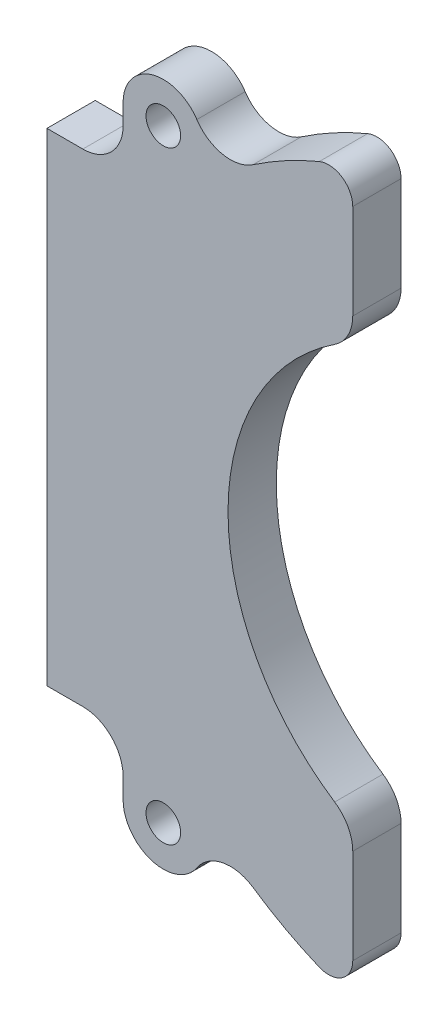
ISO-10303-21;
HEADER;
FILE_DESCRIPTION(('STEP AP214'),'2;1');
FILE_NAME('part.step','',(''),(''),'','','');
FILE_SCHEMA(('AUTOMOTIVE_DESIGN { 1 0 10303 214 1 1 1 1 }'));
ENDSEC;
DATA;
#1=APPLICATION_CONTEXT('core data for automotive mechanical design processes');
#2=APPLICATION_PROTOCOL_DEFINITION('international standard','automotive_design',2000,#1);
#3=PRODUCT_CONTEXT('',#1,'mechanical');
#4=PRODUCT('Part','Part','',(#3));
#5=PRODUCT_RELATED_PRODUCT_CATEGORY('part','',(#4));
#6=PRODUCT_DEFINITION_FORMATION('','',#4);
#7=PRODUCT_DEFINITION_CONTEXT('part definition',#1,'design');
#8=PRODUCT_DEFINITION('design','',#6,#7);
#9=PRODUCT_DEFINITION_SHAPE('','',#8);
#10=(LENGTH_UNIT() NAMED_UNIT(*) SI_UNIT(.MILLI.,.METRE.));
#11=(NAMED_UNIT(*) PLANE_ANGLE_UNIT() SI_UNIT($,.RADIAN.));
#12=(NAMED_UNIT(*) SI_UNIT($,.STERADIAN.) SOLID_ANGLE_UNIT());
#13=UNCERTAINTY_MEASURE_WITH_UNIT(LENGTH_MEASURE(1.E-05),#10,'distance_accuracy_value','');
#14=(GEOMETRIC_REPRESENTATION_CONTEXT(3) GLOBAL_UNCERTAINTY_ASSIGNED_CONTEXT((#13)) GLOBAL_UNIT_ASSIGNED_CONTEXT((#10,
#11,#12)) REPRESENTATION_CONTEXT('',''));
#15=CARTESIAN_POINT('',(0.,0.,0.));
#16=DIRECTION('',(0.,0.,1.));
#17=DIRECTION('',(1.,0.,0.));
#18=AXIS2_PLACEMENT_3D('',#15,#16,#17);
#19=CARTESIAN_POINT('',(-42.54,0.,6.));
#20=DIRECTION('',(1.,0.,0.));
#21=DIRECTION('',(0.,0.,-1.));
#22=AXIS2_PLACEMENT_3D('',#19,#20,#21);
#23=PLANE('',#22);
#24=DIRECTION('',(0.,-1.,0.));
#25=VECTOR('',#24,1.);
#26=CARTESIAN_POINT('',(-42.54,0.,0.));
#27=LINE('',#26,#25);
#28=CARTESIAN_POINT('',(-42.54,37.5,0.));
#29=VERTEX_POINT('',#28);
#30=CARTESIAN_POINT('',(-42.54,35.,0.));
#31=VERTEX_POINT('',#30);
#32=EDGE_CURVE('E200',#29,#31,#27,.T.);
#33=ORIENTED_EDGE('',*,*,#32,.T.);
#34=DIRECTION('',(0.,0.,-1.));
#35=VECTOR('',#34,1.);
#36=CARTESIAN_POINT('',(-42.54,35.,6.));
#37=LINE('',#36,#35);
#38=CARTESIAN_POINT('',(-42.54,35.,6.));
#39=VERTEX_POINT('',#38);
#40=EDGE_CURVE('E178',#39,#31,#37,.T.);
#41=ORIENTED_EDGE('',*,*,#40,.F.);
#42=DIRECTION('',(0.,-1.,0.));
#43=VECTOR('',#42,1.);
#44=CARTESIAN_POINT('',(-42.54,0.,6.));
#45=LINE('',#44,#43);
#46=CARTESIAN_POINT('',(-42.54,37.5,6.));
#47=VERTEX_POINT('',#46);
#48=EDGE_CURVE('E185',#47,#39,#45,.T.);
#49=ORIENTED_EDGE('',*,*,#48,.F.);
#50=DIRECTION('',(0.,0.,-1.));
#51=VECTOR('',#50,1.);
#52=CARTESIAN_POINT('',(-42.54,37.5,6.));
#53=LINE('',#52,#51);
#54=EDGE_CURVE('E269',#47,#29,#53,.T.);
#55=ORIENTED_EDGE('',*,*,#54,.T.);
#56=EDGE_LOOP('',(#33,#41,#49,#55));
#57=FACE_BOUND('',#56,.T.);
#58=ADVANCED_FACE('F36',(#57),#23,.F.);
#59=CARTESIAN_POINT('',(-47.54,35.,6.));
#60=DIRECTION('',(0.,0.,-1.));
#61=DIRECTION('',(-1.,0.,0.));
#62=AXIS2_PLACEMENT_3D('',#59,#60,#61);
#63=CYLINDRICAL_SURFACE('',#62,5.);
#64=CARTESIAN_POINT('',(-47.54,35.,0.));
#65=DIRECTION('',(0.,0.,1.));
#66=DIRECTION('',(1.,0.,0.));
#67=AXIS2_PLACEMENT_3D('',#64,#65,#66);
#68=CIRCLE('',#67,5.);
#69=CARTESIAN_POINT('',(-47.54,30.,0.));
#70=VERTEX_POINT('',#69);
#71=EDGE_CURVE('E278',#31,#70,#68,.F.);
#72=ORIENTED_EDGE('',*,*,#71,.T.);
#73=DIRECTION('',(0.,0.,-1.));
#74=VECTOR('',#73,1.);
#75=CARTESIAN_POINT('',(-47.54,30.,6.));
#76=LINE('',#75,#74);
#77=CARTESIAN_POINT('',(-47.54,30.,6.));
#78=VERTEX_POINT('',#77);
#79=EDGE_CURVE('E181',#78,#70,#76,.T.);
#80=ORIENTED_EDGE('',*,*,#79,.F.);
#81=CARTESIAN_POINT('',(-47.54,35.,6.));
#82=DIRECTION('',(0.,0.,1.));
#83=DIRECTION('',(1.,0.,0.));
#84=AXIS2_PLACEMENT_3D('',#81,#82,#83);
#85=CIRCLE('',#84,5.);
#86=EDGE_CURVE('E174',#39,#78,#85,.F.);
#87=ORIENTED_EDGE('',*,*,#86,.F.);
#88=ORIENTED_EDGE('',*,*,#40,.T.);
#89=EDGE_LOOP('',(#72,#80,#87,#88));
#90=FACE_BOUND('',#89,.T.);
#91=ADVANCED_FACE('F176',(#90),#63,.F.);
#92=CARTESIAN_POINT('',(0.,30.,6.));
#93=DIRECTION('',(0.,-1.,0.));
#94=DIRECTION('',(0.,0.,-1.));
#95=AXIS2_PLACEMENT_3D('',#92,#93,#94);
#96=PLANE('',#95);
#97=DIRECTION('',(-1.,0.,0.));
#98=VECTOR('',#97,1.);
#99=CARTESIAN_POINT('',(0.,30.,0.));
#100=LINE('',#99,#98);
#101=CARTESIAN_POINT('',(-52.,30.,0.));
#102=VERTEX_POINT('',#101);
#103=EDGE_CURVE('E280',#70,#102,#100,.T.);
#104=ORIENTED_EDGE('',*,*,#103,.T.);
#105=DIRECTION('',(0.,0.,-1.));
#106=VECTOR('',#105,1.);
#107=CARTESIAN_POINT('',(-52.,30.,6.));
#108=LINE('',#107,#106);
#109=CARTESIAN_POINT('',(-52.,30.,6.));
#110=VERTEX_POINT('',#109);
#111=EDGE_CURVE('E205',#110,#102,#108,.T.);
#112=ORIENTED_EDGE('',*,*,#111,.F.);
#113=DIRECTION('',(-1.,0.,0.));
#114=VECTOR('',#113,1.);
#115=CARTESIAN_POINT('',(0.,30.,6.));
#116=LINE('',#115,#114);
#117=EDGE_CURVE('E184',#78,#110,#116,.T.);
#118=ORIENTED_EDGE('',*,*,#117,.F.);
#119=ORIENTED_EDGE('',*,*,#79,.T.);
#120=EDGE_LOOP('',(#104,#112,#118,#119));
#121=FACE_BOUND('',#120,.T.);
#122=ADVANCED_FACE('F335',(#121),#96,.F.);
#123=CARTESIAN_POINT('',(-52.,0.,6.));
#124=DIRECTION('',(-1.,0.,0.));
#125=DIRECTION('',(0.,0.,1.));
#126=AXIS2_PLACEMENT_3D('',#123,#124,#125);
#127=PLANE('',#126);
#128=DIRECTION('',(0.,1.,0.));
#129=VECTOR('',#128,1.);
#130=CARTESIAN_POINT('',(-52.,0.,0.));
#131=LINE('',#130,#129);
#132=CARTESIAN_POINT('',(-52.,-30.,0.));
#133=VERTEX_POINT('',#132);
#134=EDGE_CURVE('E283',#133,#102,#131,.T.);
#135=ORIENTED_EDGE('',*,*,#134,.F.);
#136=DIRECTION('',(0.,0.,-1.));
#137=VECTOR('',#136,1.);
#138=CARTESIAN_POINT('',(-52.,-30.,6.));
#139=LINE('',#138,#137);
#140=CARTESIAN_POINT('',(-52.,-30.,6.));
#141=VERTEX_POINT('',#140);
#142=EDGE_CURVE('E325',#141,#133,#139,.T.);
#143=ORIENTED_EDGE('',*,*,#142,.F.);
#144=DIRECTION('',(0.,1.,0.));
#145=VECTOR('',#144,1.);
#146=CARTESIAN_POINT('',(-52.,0.,6.));
#147=LINE('',#146,#145);
#148=EDGE_CURVE('E332',#141,#110,#147,.T.);
#149=ORIENTED_EDGE('',*,*,#148,.T.);
#150=ORIENTED_EDGE('',*,*,#111,.T.);
#151=EDGE_LOOP('',(#135,#143,#149,#150));
#152=FACE_BOUND('',#151,.T.);
#153=ADVANCED_FACE('F330',(#152),#127,.T.);
#154=CARTESIAN_POINT('',(0.,-30.,6.));
#155=DIRECTION('',(0.,-1.,0.));
#156=DIRECTION('',(0.,0.,-1.));
#157=AXIS2_PLACEMENT_3D('',#154,#155,#156);
#158=PLANE('',#157);
#159=DIRECTION('',(-1.,0.,0.));
#160=VECTOR('',#159,1.);
#161=CARTESIAN_POINT('',(0.,-30.,0.));
#162=LINE('',#161,#160);
#163=CARTESIAN_POINT('',(-47.54,-30.,0.));
#164=VERTEX_POINT('',#163);
#165=EDGE_CURVE('E286',#164,#133,#162,.T.);
#166=ORIENTED_EDGE('',*,*,#165,.F.);
#167=DIRECTION('',(0.,0.,-1.));
#168=VECTOR('',#167,1.);
#169=CARTESIAN_POINT('',(-47.54,-30.,6.));
#170=LINE('',#169,#168);
#171=CARTESIAN_POINT('',(-47.54,-30.,6.));
#172=VERTEX_POINT('',#171);
#173=EDGE_CURVE('E323',#172,#164,#170,.T.);
#174=ORIENTED_EDGE('',*,*,#173,.F.);
#175=DIRECTION('',(-1.,0.,0.));
#176=VECTOR('',#175,1.);
#177=CARTESIAN_POINT('',(0.,-30.,6.));
#178=LINE('',#177,#176);
#179=EDGE_CURVE('E345',#172,#141,#178,.T.);
#180=ORIENTED_EDGE('',*,*,#179,.T.);
#181=ORIENTED_EDGE('',*,*,#142,.T.);
#182=EDGE_LOOP('',(#166,#174,#180,#181));
#183=FACE_BOUND('',#182,.T.);
#184=ADVANCED_FACE('F341',(#183),#158,.T.);
#185=CARTESIAN_POINT('',(-47.54,-35.,6.));
#186=DIRECTION('',(0.,0.,-1.));
#187=DIRECTION('',(-1.,0.,0.));
#188=AXIS2_PLACEMENT_3D('',#185,#186,#187);
#189=CYLINDRICAL_SURFACE('',#188,5.);
#190=CARTESIAN_POINT('',(-47.54,-35.,0.));
#191=DIRECTION('',(0.,0.,1.));
#192=DIRECTION('',(1.,0.,0.));
#193=AXIS2_PLACEMENT_3D('',#190,#191,#192);
#194=CIRCLE('',#193,5.);
#195=CARTESIAN_POINT('',(-42.54,-35.,0.));
#196=VERTEX_POINT('',#195);
#197=EDGE_CURVE('E289',#164,#196,#194,.F.);
#198=ORIENTED_EDGE('',*,*,#197,.T.);
#199=DIRECTION('',(0.,0.,-1.));
#200=VECTOR('',#199,1.);
#201=CARTESIAN_POINT('',(-42.54,-35.,6.));
#202=LINE('',#201,#200);
#203=CARTESIAN_POINT('',(-42.54,-35.,6.));
#204=VERTEX_POINT('',#203);
#205=EDGE_CURVE('E321',#204,#196,#202,.T.);
#206=ORIENTED_EDGE('',*,*,#205,.F.);
#207=CARTESIAN_POINT('',(-47.54,-35.,6.));
#208=DIRECTION('',(0.,0.,1.));
#209=DIRECTION('',(1.,0.,0.));
#210=AXIS2_PLACEMENT_3D('',#207,#208,#209);
#211=CIRCLE('',#210,5.);
#212=EDGE_CURVE('E347',#172,#204,#211,.F.);
#213=ORIENTED_EDGE('',*,*,#212,.F.);
#214=ORIENTED_EDGE('',*,*,#173,.T.);
#215=EDGE_LOOP('',(#198,#206,#213,#214));
#216=FACE_BOUND('',#215,.T.);
#217=ADVANCED_FACE('F368',(#216),#189,.F.);
#218=CARTESIAN_POINT('',(-42.54,0.,6.));
#219=DIRECTION('',(-1.,0.,0.));
#220=DIRECTION('',(0.,0.,1.));
#221=AXIS2_PLACEMENT_3D('',#218,#219,#220);
#222=PLANE('',#221);
#223=DIRECTION('',(0.,1.,0.));
#224=VECTOR('',#223,1.);
#225=CARTESIAN_POINT('',(-42.54,0.,0.));
#226=LINE('',#225,#224);
#227=CARTESIAN_POINT('',(-42.54,-37.5,0.));
#228=VERTEX_POINT('',#227);
#229=EDGE_CURVE('E292',#228,#196,#226,.T.);
#230=ORIENTED_EDGE('',*,*,#229,.F.);
#231=DIRECTION('',(0.,0.,-1.));
#232=VECTOR('',#231,1.);
#233=CARTESIAN_POINT('',(-42.54,-37.5,6.));
#234=LINE('',#233,#232);
#235=CARTESIAN_POINT('',(-42.54,-37.5,6.));
#236=VERTEX_POINT('',#235);
#237=EDGE_CURVE('E319',#236,#228,#234,.T.);
#238=ORIENTED_EDGE('',*,*,#237,.F.);
#239=DIRECTION('',(0.,1.,0.));
#240=VECTOR('',#239,1.);
#241=CARTESIAN_POINT('',(-42.54,0.,6.));
#242=LINE('',#241,#240);
#243=EDGE_CURVE('E352',#236,#204,#242,.T.);
#244=ORIENTED_EDGE('',*,*,#243,.T.);
#245=ORIENTED_EDGE('',*,*,#205,.T.);
#246=EDGE_LOOP('',(#230,#238,#244,#245));
#247=FACE_BOUND('',#246,.T.);
#248=ADVANCED_FACE('F365',(#247),#222,.T.);
#249=CARTESIAN_POINT('',(-37.54,-37.5,6.));
#250=DIRECTION('',(0.,0.,-1.));
#251=DIRECTION('',(-1.,0.,0.));
#252=AXIS2_PLACEMENT_3D('',#249,#250,#251);
#253=CYLINDRICAL_SURFACE('',#252,5.);
#254=CARTESIAN_POINT('',(-37.54,-37.5,0.));
#255=DIRECTION('',(0.,0.,1.));
#256=DIRECTION('',(1.,0.,0.));
#257=AXIS2_PLACEMENT_3D('',#254,#255,#256);
#258=CIRCLE('',#257,5.);
#259=CARTESIAN_POINT('',(-33.3722359848189,-40.262198963464,0.));
#260=VERTEX_POINT('',#259);
#261=EDGE_CURVE('E295',#228,#260,#258,.T.);
#262=ORIENTED_EDGE('',*,*,#261,.T.);
#263=DIRECTION('',(0.,0.,-1.));
#264=VECTOR('',#263,1.);
#265=CARTESIAN_POINT('',(-33.3722359848189,-40.262198963464,6.));
#266=LINE('',#265,#264);
#267=CARTESIAN_POINT('',(-33.3722359848189,-40.262198963464,6.));
#268=VERTEX_POINT('',#267);
#269=EDGE_CURVE('E316',#268,#260,#266,.T.);
#270=ORIENTED_EDGE('',*,*,#269,.F.);
#271=CARTESIAN_POINT('',(-37.54,-37.5,6.));
#272=DIRECTION('',(0.,0.,1.));
#273=DIRECTION('',(1.,0.,0.));
#274=AXIS2_PLACEMENT_3D('',#271,#272,#273);
#275=CIRCLE('',#274,5.);
#276=EDGE_CURVE('E262',#236,#268,#275,.T.);
#277=ORIENTED_EDGE('',*,*,#276,.F.);
#278=ORIENTED_EDGE('',*,*,#237,.T.);
#279=EDGE_LOOP('',(#262,#270,#277,#278));
#280=FACE_BOUND('',#279,.T.);
#281=ADVANCED_FACE('F358',(#280),#253,.T.);
#282=CARTESIAN_POINT('',(-29.2044719696378,-43.0243979269279,6.));
#283=DIRECTION('',(0.,0.,-1.));
#284=DIRECTION('',(-1.,0.,0.));
#285=AXIS2_PLACEMENT_3D('',#282,#283,#284);
#286=CYLINDRICAL_SURFACE('',#285,5.);
#287=CARTESIAN_POINT('',(-29.2044719696378,-43.0243979269279,0.));
#288=DIRECTION('',(0.,0.,1.));
#289=DIRECTION('',(1.,0.,0.));
#290=AXIS2_PLACEMENT_3D('',#287,#288,#289);
#291=CIRCLE('',#290,5.);
#292=CARTESIAN_POINT('',(-26.3963496648649,-38.8874365878002,0.));
#293=VERTEX_POINT('',#292);
#294=EDGE_CURVE('E297',#260,#293,#291,.F.);
#295=ORIENTED_EDGE('',*,*,#294,.T.);
#296=DIRECTION('',(0.,0.,-1.));
#297=VECTOR('',#296,1.);
#298=CARTESIAN_POINT('',(-26.3963496648649,-38.8874365878002,6.));
#299=LINE('',#298,#297);
#300=CARTESIAN_POINT('',(-26.3963496648649,-38.8874365878002,6.));
#301=VERTEX_POINT('',#300);
#302=EDGE_CURVE('E314',#301,#293,#299,.T.);
#303=ORIENTED_EDGE('',*,*,#302,.F.);
#304=CARTESIAN_POINT('',(-29.2044719696378,-43.0243979269279,6.));
#305=DIRECTION('',(0.,0.,1.));
#306=DIRECTION('',(1.,0.,0.));
#307=AXIS2_PLACEMENT_3D('',#304,#305,#306);
#308=CIRCLE('',#307,5.);
#309=EDGE_CURVE('E256',#268,#301,#308,.F.);
#310=ORIENTED_EDGE('',*,*,#309,.F.);
#311=ORIENTED_EDGE('',*,*,#269,.T.);
#312=EDGE_LOOP('',(#295,#303,#310,#311));
#313=FACE_BOUND('',#312,.T.);
#314=ADVANCED_FACE('F362',(#313),#286,.F.);
#315=CARTESIAN_POINT('',(0.,0.,6.));
#316=DIRECTION('',(0.,0.,-1.));
#317=DIRECTION('',(-1.,0.,0.));
#318=AXIS2_PLACEMENT_3D('',#315,#316,#317);
#319=CYLINDRICAL_SURFACE('',#318,47.);
#320=CARTESIAN_POINT('',(0.,0.,0.));
#321=DIRECTION('',(0.,0.,1.));
#322=DIRECTION('',(1.,0.,0.));
#323=AXIS2_PLACEMENT_3D('',#320,#321,#322);
#324=CIRCLE('',#323,47.);
#325=CARTESIAN_POINT('',(-18.1590909090909,-43.3502873964565,0.));
#326=VERTEX_POINT('',#325);
#327=EDGE_CURVE('E252',#293,#326,#324,.T.);
#328=ORIENTED_EDGE('',*,*,#327,.T.);
#329=DIRECTION('',(0.,0.,-1.));
#330=VECTOR('',#329,1.);
#331=CARTESIAN_POINT('',(-18.1590909090909,-43.3502873964565,6.));
#332=LINE('',#331,#330);
#333=CARTESIAN_POINT('',(-18.1590909090909,-43.3502873964565,6.));
#334=VERTEX_POINT('',#333);
#335=EDGE_CURVE('E44',#326,#334,#332,.F.);
#336=ORIENTED_EDGE('',*,*,#335,.T.);
#337=CARTESIAN_POINT('',(0.,0.,6.));
#338=DIRECTION('',(0.,0.,1.));
#339=DIRECTION('',(1.,0.,0.));
#340=AXIS2_PLACEMENT_3D('',#337,#338,#339);
#341=CIRCLE('',#340,47.);
#342=EDGE_CURVE('E251',#301,#334,#341,.T.);
#343=ORIENTED_EDGE('',*,*,#342,.F.);
#344=ORIENTED_EDGE('',*,*,#302,.T.);
#345=EDGE_LOOP('',(#328,#336,#343,#344));
#346=FACE_BOUND('',#345,.T.);
#347=ADVANCED_FACE('F249',(#346),#319,.T.);
#348=CARTESIAN_POINT('',(0.,0.,6.));
#349=DIRECTION('',(0.,0.,-1.));
#350=DIRECTION('',(-1.,0.,0.));
#351=AXIS2_PLACEMENT_3D('',#348,#349,#350);
#352=CYLINDRICAL_SURFACE('',#351,47.);
#353=CARTESIAN_POINT('',(0.,0.,6.));
#354=DIRECTION('',(0.,0.,1.));
#355=DIRECTION('',(1.,0.,0.));
#356=AXIS2_PLACEMENT_3D('',#353,#354,#355);
#357=CIRCLE('',#356,47.);
#358=CARTESIAN_POINT('',(-18.1590909090909,43.3502873964565,6.));
#359=VERTEX_POINT('',#358);
#360=CARTESIAN_POINT('',(-26.3963496648649,38.8874365878003,6.));
#361=VERTEX_POINT('',#360);
#362=EDGE_CURVE('E258',#359,#361,#357,.T.);
#363=ORIENTED_EDGE('',*,*,#362,.F.);
#364=DIRECTION('',(0.,0.,-1.));
#365=VECTOR('',#364,1.);
#366=CARTESIAN_POINT('',(-18.1590909090909,43.3502873964565,6.));
#367=LINE('',#366,#365);
#368=CARTESIAN_POINT('',(-18.1590909090909,43.3502873964565,0.));
#369=VERTEX_POINT('',#368);
#370=EDGE_CURVE('E240',#359,#369,#367,.T.);
#371=ORIENTED_EDGE('',*,*,#370,.T.);
#372=CARTESIAN_POINT('',(0.,0.,0.));
#373=DIRECTION('',(0.,0.,1.));
#374=DIRECTION('',(1.,0.,0.));
#375=AXIS2_PLACEMENT_3D('',#372,#373,#374);
#376=CIRCLE('',#375,47.);
#377=CARTESIAN_POINT('',(-26.3963496648649,38.8874365878003,0.));
#378=VERTEX_POINT('',#377);
#379=EDGE_CURVE('E300',#369,#378,#376,.T.);
#380=ORIENTED_EDGE('',*,*,#379,.T.);
#381=DIRECTION('',(0.,0.,-1.));
#382=VECTOR('',#381,1.);
#383=CARTESIAN_POINT('',(-26.3963496648649,38.8874365878003,6.));
#384=LINE('',#383,#382);
#385=EDGE_CURVE('E311',#361,#378,#384,.T.);
#386=ORIENTED_EDGE('',*,*,#385,.F.);
#387=EDGE_LOOP('',(#363,#371,#380,#386));
#388=FACE_BOUND('',#387,.T.);
#389=ADVANCED_FACE('F453',(#388),#352,.T.);
#390=CARTESIAN_POINT('',(-29.2044719696378,43.0243979269279,6.));
#391=DIRECTION('',(0.,0.,-1.));
#392=DIRECTION('',(-1.,0.,0.));
#393=AXIS2_PLACEMENT_3D('',#390,#391,#392);
#394=CYLINDRICAL_SURFACE('',#393,5.);
#395=CARTESIAN_POINT('',(-29.2044719696378,43.0243979269279,0.));
#396=DIRECTION('',(0.,0.,1.));
#397=DIRECTION('',(1.,0.,0.));
#398=AXIS2_PLACEMENT_3D('',#395,#396,#397);
#399=CIRCLE('',#398,5.);
#400=CARTESIAN_POINT('',(-33.3722359848189,40.262198963464,0.));
#401=VERTEX_POINT('',#400);
#402=EDGE_CURVE('E302',#401,#378,#399,.T.);
#403=ORIENTED_EDGE('',*,*,#402,.F.);
#404=DIRECTION('',(0.,0.,-1.));
#405=VECTOR('',#404,1.);
#406=CARTESIAN_POINT('',(-33.3722359848189,40.262198963464,6.));
#407=LINE('',#406,#405);
#408=CARTESIAN_POINT('',(-33.3722359848189,40.262198963464,6.));
#409=VERTEX_POINT('',#408);
#410=EDGE_CURVE('E309',#409,#401,#407,.T.);
#411=ORIENTED_EDGE('',*,*,#410,.F.);
#412=CARTESIAN_POINT('',(-29.2044719696378,43.0243979269279,6.));
#413=DIRECTION('',(0.,0.,1.));
#414=DIRECTION('',(1.,0.,0.));
#415=AXIS2_PLACEMENT_3D('',#412,#413,#414);
#416=CIRCLE('',#415,5.);
#417=EDGE_CURVE('E260',#409,#361,#416,.T.);
#418=ORIENTED_EDGE('',*,*,#417,.T.);
#419=ORIENTED_EDGE('',*,*,#385,.T.);
#420=EDGE_LOOP('',(#403,#411,#418,#419));
#421=FACE_BOUND('',#420,.T.);
#422=ADVANCED_FACE('F389',(#421),#394,.F.);
#423=CARTESIAN_POINT('',(-37.54,-37.5,6.));
#424=DIRECTION('',(0.,0.,-1.));
#425=DIRECTION('',(-1.,0.,0.));
#426=AXIS2_PLACEMENT_3D('',#423,#424,#425);
#427=CYLINDRICAL_SURFACE('',#426,2.15);
#428=CARTESIAN_POINT('',(-37.54,-37.5,6.));
#429=DIRECTION('',(0.,0.,1.));
#430=DIRECTION('',(1.,0.,0.));
#431=AXIS2_PLACEMENT_3D('',#428,#429,#430);
#432=CIRCLE('',#431,2.15);
#433=CARTESIAN_POINT('',(-35.39,-37.5,6.));
#434=VERTEX_POINT('',#433);
#435=EDGE_CURVE('E197',#434,#434,#432,.T.);
#436=ORIENTED_EDGE('',*,*,#435,.T.);
#437=EDGE_LOOP('',(#436));
#438=FACE_BOUND('',#437,.T.);
#439=CARTESIAN_POINT('',(-37.54,-37.5,0.));
#440=DIRECTION('',(0.,0.,1.));
#441=DIRECTION('',(1.,0.,0.));
#442=AXIS2_PLACEMENT_3D('',#439,#440,#441);
#443=CIRCLE('',#442,2.15);
#444=CARTESIAN_POINT('',(-35.39,-37.5,0.));
#445=VERTEX_POINT('',#444);
#446=EDGE_CURVE('E273',#445,#445,#443,.T.);
#447=ORIENTED_EDGE('',*,*,#446,.F.);
#448=EDGE_LOOP('',(#447));
#449=FACE_BOUND('',#448,.T.);
#450=ADVANCED_FACE('F385',(#438,#449),#427,.F.);
#451=CARTESIAN_POINT('',(-37.54,37.5,6.));
#452=DIRECTION('',(0.,0.,-1.));
#453=DIRECTION('',(-1.,0.,0.));
#454=AXIS2_PLACEMENT_3D('',#451,#452,#453);
#455=CYLINDRICAL_SURFACE('',#454,2.15);
#456=CARTESIAN_POINT('',(-37.54,37.5,6.));
#457=DIRECTION('',(0.,0.,1.));
#458=DIRECTION('',(1.,0.,0.));
#459=AXIS2_PLACEMENT_3D('',#456,#457,#458);
#460=CIRCLE('',#459,2.15);
#461=CARTESIAN_POINT('',(-35.39,37.5,6.));
#462=VERTEX_POINT('',#461);
#463=EDGE_CURVE('E307',#462,#462,#460,.T.);
#464=ORIENTED_EDGE('',*,*,#463,.T.);
#465=EDGE_LOOP('',(#464));
#466=FACE_BOUND('',#465,.T.);
#467=CARTESIAN_POINT('',(-37.54,37.5,0.));
#468=DIRECTION('',(0.,0.,1.));
#469=DIRECTION('',(1.,0.,0.));
#470=AXIS2_PLACEMENT_3D('',#467,#468,#469);
#471=CIRCLE('',#470,2.15);
#472=CARTESIAN_POINT('',(-35.39,37.5,0.));
#473=VERTEX_POINT('',#472);
#474=EDGE_CURVE('E270',#473,#473,#471,.T.);
#475=ORIENTED_EDGE('',*,*,#474,.F.);
#476=EDGE_LOOP('',(#475));
#477=FACE_BOUND('',#476,.T.);
#478=ADVANCED_FACE('F388',(#466,#477),#455,.F.);
#479=CARTESIAN_POINT('',(-37.54,37.5,6.));
#480=DIRECTION('',(0.,0.,-1.));
#481=DIRECTION('',(-1.,0.,0.));
#482=AXIS2_PLACEMENT_3D('',#479,#480,#481);
#483=CYLINDRICAL_SURFACE('',#482,5.);
#484=CARTESIAN_POINT('',(-37.54,37.5,0.));
#485=DIRECTION('',(0.,0.,1.));
#486=DIRECTION('',(1.,0.,0.));
#487=AXIS2_PLACEMENT_3D('',#484,#485,#486);
#488=CIRCLE('',#487,5.);
#489=EDGE_CURVE('E305',#401,#29,#488,.T.);
#490=ORIENTED_EDGE('',*,*,#489,.T.);
#491=ORIENTED_EDGE('',*,*,#54,.F.);
#492=CARTESIAN_POINT('',(-37.54,37.5,6.));
#493=DIRECTION('',(0.,0.,1.));
#494=DIRECTION('',(1.,0.,0.));
#495=AXIS2_PLACEMENT_3D('',#492,#493,#494);
#496=CIRCLE('',#495,5.);
#497=EDGE_CURVE('E193',#409,#47,#496,.T.);
#498=ORIENTED_EDGE('',*,*,#497,.F.);
#499=ORIENTED_EDGE('',*,*,#410,.T.);
#500=EDGE_LOOP('',(#490,#491,#498,#499));
#501=FACE_BOUND('',#500,.T.);
#502=ADVANCED_FACE('F393',(#501),#483,.T.);
#503=CARTESIAN_POINT('',(0.,0.,6.));
#504=DIRECTION('',(0.,0.,1.));
#505=DIRECTION('',(1.,0.,0.));
#506=AXIS2_PLACEMENT_3D('',#503,#504,#505);
#507=PLANE('',#506);
#508=DIRECTION('',(0.,-1.,0.));
#509=VECTOR('',#508,1.);
#510=CARTESIAN_POINT('',(-14.,44.8664685483491,6.));
#511=LINE('',#510,#509);
#512=CARTESIAN_POINT('',(-14.,40.5832477754061,6.));
#513=VERTEX_POINT('',#512);
#514=CARTESIAN_POINT('',(-14.,28.7967011999639,6.));
#515=VERTEX_POINT('',#514);
#516=EDGE_CURVE('E416',#513,#515,#511,.T.);
#517=ORIENTED_EDGE('',*,*,#516,.F.);
#518=CARTESIAN_POINT('',(-17.,40.5832477754061,6.));
#519=DIRECTION('',(0.,0.,1.));
#520=DIRECTION('',(1.,0.,0.));
#521=AXIS2_PLACEMENT_3D('',#518,#519,#520);
#522=CIRCLE('',#521,3.);
#523=EDGE_CURVE('E238',#513,#359,#522,.T.);
#524=ORIENTED_EDGE('',*,*,#523,.T.);
#525=ORIENTED_EDGE('',*,*,#362,.T.);
#526=ORIENTED_EDGE('',*,*,#417,.F.);
#527=ORIENTED_EDGE('',*,*,#497,.T.);
#528=ORIENTED_EDGE('',*,*,#48,.T.);
#529=ORIENTED_EDGE('',*,*,#86,.T.);
#530=ORIENTED_EDGE('',*,*,#117,.T.);
#531=ORIENTED_EDGE('',*,*,#148,.F.);
#532=ORIENTED_EDGE('',*,*,#179,.F.);
#533=ORIENTED_EDGE('',*,*,#212,.T.);
#534=ORIENTED_EDGE('',*,*,#243,.F.);
#535=ORIENTED_EDGE('',*,*,#276,.T.);
#536=ORIENTED_EDGE('',*,*,#309,.T.);
#537=ORIENTED_EDGE('',*,*,#342,.T.);
#538=CARTESIAN_POINT('',(-17.,-40.5832477754061,6.));
#539=DIRECTION('',(0.,0.,1.));
#540=DIRECTION('',(1.,0.,0.));
#541=AXIS2_PLACEMENT_3D('',#538,#539,#540);
#542=CIRCLE('',#541,3.);
#543=CARTESIAN_POINT('',(-14.,-40.5832477754061,6.));
#544=VERTEX_POINT('',#543);
#545=EDGE_CURVE('E236',#334,#544,#542,.T.);
#546=ORIENTED_EDGE('',*,*,#545,.T.);
#547=DIRECTION('',(0.,-1.,0.));
#548=VECTOR('',#547,1.);
#549=CARTESIAN_POINT('',(-14.,-25.9663243451976,6.));
#550=LINE('',#549,#548);
#551=CARTESIAN_POINT('',(-14.,-28.7967011999639,6.));
#552=VERTEX_POINT('',#551);
#553=EDGE_CURVE('E274',#552,#544,#550,.T.);
#554=ORIENTED_EDGE('',*,*,#553,.F.);
#555=CARTESIAN_POINT('',(-19.,-28.7967011999639,6.));
#556=DIRECTION('',(0.,0.,1.));
#557=DIRECTION('',(1.,0.,0.));
#558=AXIS2_PLACEMENT_3D('',#555,#556,#557);
#559=CIRCLE('',#558,5.);
#560=CARTESIAN_POINT('',(-16.2463768115942,-24.6232662434474,6.));
#561=VERTEX_POINT('',#560);
#562=EDGE_CURVE('E218',#552,#561,#559,.T.);
#563=ORIENTED_EDGE('',*,*,#562,.T.);
#564=CARTESIAN_POINT('',(0.,0.,6.));
#565=DIRECTION('',(0.,0.,1.));
#566=DIRECTION('',(1.,0.,0.));
#567=AXIS2_PLACEMENT_3D('',#564,#565,#566);
#568=CIRCLE('',#567,29.5);
#569=CARTESIAN_POINT('',(-16.2463768115942,24.6232662434474,6.));
#570=VERTEX_POINT('',#569);
#571=EDGE_CURVE('E425',#570,#561,#568,.T.);
#572=ORIENTED_EDGE('',*,*,#571,.F.);
#573=CARTESIAN_POINT('',(-19.,28.7967011999639,6.));
#574=DIRECTION('',(0.,0.,1.));
#575=DIRECTION('',(1.,0.,0.));
#576=AXIS2_PLACEMENT_3D('',#573,#574,#575);
#577=CIRCLE('',#576,5.);
#578=EDGE_CURVE('E220',#570,#515,#577,.T.);
#579=ORIENTED_EDGE('',*,*,#578,.T.);
#580=EDGE_LOOP('',(#517,#524,#525,#526,#527,#528,#529,#530,#531,#532,#533,#534,#535,#536,#537,
#546,#554,#563,#572,#579));
#581=FACE_BOUND('',#580,.T.);
#582=ORIENTED_EDGE('',*,*,#463,.F.);
#583=EDGE_LOOP('',(#582));
#584=FACE_BOUND('',#583,.T.);
#585=ORIENTED_EDGE('',*,*,#435,.F.);
#586=EDGE_LOOP('',(#585));
#587=FACE_BOUND('',#586,.T.);
#588=ADVANCED_FACE('F189',(#581,#584,#587),#507,.T.);
#589=CARTESIAN_POINT('',(0.,0.,0.));
#590=DIRECTION('',(0.,0.,1.));
#591=DIRECTION('',(1.,0.,0.));
#592=AXIS2_PLACEMENT_3D('',#589,#590,#591);
#593=PLANE('',#592);
#594=ORIENTED_EDGE('',*,*,#474,.T.);
#595=EDGE_LOOP('',(#594));
#596=FACE_BOUND('',#595,.T.);
#597=ORIENTED_EDGE('',*,*,#446,.T.);
#598=EDGE_LOOP('',(#597));
#599=FACE_BOUND('',#598,.T.);
#600=ORIENTED_EDGE('',*,*,#379,.F.);
#601=CARTESIAN_POINT('',(-17.,40.5832477754061,0.));
#602=DIRECTION('',(0.,0.,1.));
#603=DIRECTION('',(1.,0.,0.));
#604=AXIS2_PLACEMENT_3D('',#601,#602,#603);
#605=CIRCLE('',#604,3.);
#606=CARTESIAN_POINT('',(-14.,40.5832477754061,0.));
#607=VERTEX_POINT('',#606);
#608=EDGE_CURVE('E243',#369,#607,#605,.F.);
#609=ORIENTED_EDGE('',*,*,#608,.T.);
#610=DIRECTION('',(0.,-1.,0.));
#611=VECTOR('',#610,1.);
#612=CARTESIAN_POINT('',(-14.,0.,0.));
#613=LINE('',#612,#611);
#614=CARTESIAN_POINT('',(-14.,28.7967011999639,0.));
#615=VERTEX_POINT('',#614);
#616=EDGE_CURVE('E201',#607,#615,#613,.T.);
#617=ORIENTED_EDGE('',*,*,#616,.T.);
#618=CARTESIAN_POINT('',(-19.,28.7967011999639,0.));
#619=DIRECTION('',(0.,0.,1.));
#620=DIRECTION('',(1.,0.,0.));
#621=AXIS2_PLACEMENT_3D('',#618,#619,#620);
#622=CIRCLE('',#621,5.);
#623=CARTESIAN_POINT('',(-16.2463768115942,24.6232662434474,0.));
#624=VERTEX_POINT('',#623);
#625=EDGE_CURVE('E228',#615,#624,#622,.F.);
#626=ORIENTED_EDGE('',*,*,#625,.T.);
#627=CARTESIAN_POINT('',(0.,0.,0.));
#628=DIRECTION('',(0.,0.,1.));
#629=DIRECTION('',(1.,0.,0.));
#630=AXIS2_PLACEMENT_3D('',#627,#628,#629);
#631=CIRCLE('',#630,29.5);
#632=CARTESIAN_POINT('',(-16.2463768115942,-24.6232662434474,0.));
#633=VERTEX_POINT('',#632);
#634=EDGE_CURVE('E203',#624,#633,#631,.T.);
#635=ORIENTED_EDGE('',*,*,#634,.T.);
#636=CARTESIAN_POINT('',(-19.,-28.7967011999639,0.));
#637=DIRECTION('',(0.,0.,1.));
#638=DIRECTION('',(1.,0.,0.));
#639=AXIS2_PLACEMENT_3D('',#636,#637,#638);
#640=CIRCLE('',#639,5.);
#641=CARTESIAN_POINT('',(-14.,-28.7967011999639,0.));
#642=VERTEX_POINT('',#641);
#643=EDGE_CURVE('E226',#633,#642,#640,.F.);
#644=ORIENTED_EDGE('',*,*,#643,.T.);
#645=DIRECTION('',(0.,-1.,0.));
#646=VECTOR('',#645,1.);
#647=CARTESIAN_POINT('',(-14.,0.,0.));
#648=LINE('',#647,#646);
#649=CARTESIAN_POINT('',(-14.,-40.5832477754061,0.));
#650=VERTEX_POINT('',#649);
#651=EDGE_CURVE('E211',#642,#650,#648,.T.);
#652=ORIENTED_EDGE('',*,*,#651,.T.);
#653=CARTESIAN_POINT('',(-17.,-40.5832477754061,0.));
#654=DIRECTION('',(0.,0.,1.));
#655=DIRECTION('',(1.,0.,0.));
#656=AXIS2_PLACEMENT_3D('',#653,#654,#655);
#657=CIRCLE('',#656,3.);
#658=EDGE_CURVE('E51',#650,#326,#657,.F.);
#659=ORIENTED_EDGE('',*,*,#658,.T.);
#660=ORIENTED_EDGE('',*,*,#327,.F.);
#661=ORIENTED_EDGE('',*,*,#294,.F.);
#662=ORIENTED_EDGE('',*,*,#261,.F.);
#663=ORIENTED_EDGE('',*,*,#229,.T.);
#664=ORIENTED_EDGE('',*,*,#197,.F.);
#665=ORIENTED_EDGE('',*,*,#165,.T.);
#666=ORIENTED_EDGE('',*,*,#134,.T.);
#667=ORIENTED_EDGE('',*,*,#103,.F.);
#668=ORIENTED_EDGE('',*,*,#71,.F.);
#669=ORIENTED_EDGE('',*,*,#32,.F.);
#670=ORIENTED_EDGE('',*,*,#489,.F.);
#671=ORIENTED_EDGE('',*,*,#402,.T.);
#672=EDGE_LOOP('',(#600,#609,#617,#626,#635,#644,#652,#659,#660,#661,#662,#663,#664,#665,#666,
#667,#668,#669,#670,#671));
#673=FACE_BOUND('',#672,.T.);
#674=ADVANCED_FACE('F337',(#596,#599,#673),#593,.F.);
#675=CARTESIAN_POINT('',(-14.,-25.9663243451976,-4.));
#676=DIRECTION('',(-1.,0.,0.));
#677=DIRECTION('',(0.,-1.,0.));
#678=AXIS2_PLACEMENT_3D('',#675,#676,#677);
#679=PLANE('',#678);
#680=ORIENTED_EDGE('',*,*,#553,.T.);
#681=DIRECTION('',(0.,0.,-1.));
#682=VECTOR('',#681,1.);
#683=CARTESIAN_POINT('',(-14.,-40.5832477754061,-4.));
#684=LINE('',#683,#682);
#685=EDGE_CURVE('E11',#544,#650,#684,.T.);
#686=ORIENTED_EDGE('',*,*,#685,.T.);
#687=ORIENTED_EDGE('',*,*,#651,.F.);
#688=DIRECTION('',(0.,0.,1.));
#689=VECTOR('',#688,1.);
#690=CARTESIAN_POINT('',(-14.,-28.7967011999639,-4.));
#691=LINE('',#690,#689);
#692=EDGE_CURVE('E230',#642,#552,#691,.T.);
#693=ORIENTED_EDGE('',*,*,#692,.T.);
#694=EDGE_LOOP('',(#680,#686,#687,#693));
#695=FACE_BOUND('',#694,.T.);
#696=ADVANCED_FACE('F427',(#695),#679,.F.);
#697=CARTESIAN_POINT('',(0.,0.,-4.));
#698=DIRECTION('',(0.,0.,1.));
#699=DIRECTION('',(1.,0.,0.));
#700=AXIS2_PLACEMENT_3D('',#697,#698,#699);
#701=CYLINDRICAL_SURFACE('',#700,29.5);
#702=ORIENTED_EDGE('',*,*,#634,.F.);
#703=DIRECTION('',(0.,0.,1.));
#704=VECTOR('',#703,1.);
#705=CARTESIAN_POINT('',(-16.2463768115942,24.6232662434474,-4.));
#706=LINE('',#705,#704);
#707=EDGE_CURVE('E215',#624,#570,#706,.T.);
#708=ORIENTED_EDGE('',*,*,#707,.T.);
#709=ORIENTED_EDGE('',*,*,#571,.T.);
#710=DIRECTION('',(0.,0.,1.));
#711=VECTOR('',#710,1.);
#712=CARTESIAN_POINT('',(-16.2463768115942,-24.6232662434474,-4.));
#713=LINE('',#712,#711);
#714=EDGE_CURVE('E213',#561,#633,#713,.F.);
#715=ORIENTED_EDGE('',*,*,#714,.T.);
#716=EDGE_LOOP('',(#702,#708,#709,#715));
#717=FACE_BOUND('',#716,.T.);
#718=ADVANCED_FACE('F421',(#717),#701,.F.);
#719=CARTESIAN_POINT('',(-14.,44.8664685483491,-4.));
#720=DIRECTION('',(-1.,0.,0.));
#721=DIRECTION('',(0.,-1.,0.));
#722=AXIS2_PLACEMENT_3D('',#719,#720,#721);
#723=PLANE('',#722);
#724=ORIENTED_EDGE('',*,*,#616,.F.);
#725=DIRECTION('',(0.,0.,-1.));
#726=VECTOR('',#725,1.);
#727=CARTESIAN_POINT('',(-14.,40.5832477754061,-4.));
#728=LINE('',#727,#726);
#729=EDGE_CURVE('E233',#607,#513,#728,.F.);
#730=ORIENTED_EDGE('',*,*,#729,.T.);
#731=ORIENTED_EDGE('',*,*,#516,.T.);
#732=DIRECTION('',(0.,0.,1.));
#733=VECTOR('',#732,1.);
#734=CARTESIAN_POINT('',(-14.,28.7967011999639,-4.));
#735=LINE('',#734,#733);
#736=EDGE_CURVE('E223',#515,#615,#735,.F.);
#737=ORIENTED_EDGE('',*,*,#736,.T.);
#738=EDGE_LOOP('',(#724,#730,#731,#737));
#739=FACE_BOUND('',#738,.T.);
#740=ADVANCED_FACE('F399',(#739),#723,.F.);
#741=CARTESIAN_POINT('',(-19.,28.7967011999639,-4.));
#742=DIRECTION('',(0.,0.,1.));
#743=DIRECTION('',(1.,0.,0.));
#744=AXIS2_PLACEMENT_3D('',#741,#742,#743);
#745=CYLINDRICAL_SURFACE('',#744,5.);
#746=ORIENTED_EDGE('',*,*,#625,.F.);
#747=ORIENTED_EDGE('',*,*,#736,.F.);
#748=ORIENTED_EDGE('',*,*,#578,.F.);
#749=ORIENTED_EDGE('',*,*,#707,.F.);
#750=EDGE_LOOP('',(#746,#747,#748,#749));
#751=FACE_BOUND('',#750,.T.);
#752=ADVANCED_FACE('F395',(#751),#745,.T.);
#753=CARTESIAN_POINT('',(-19.,-28.7967011999639,-4.));
#754=DIRECTION('',(0.,0.,1.));
#755=DIRECTION('',(1.,0.,0.));
#756=AXIS2_PLACEMENT_3D('',#753,#754,#755);
#757=CYLINDRICAL_SURFACE('',#756,5.);
#758=ORIENTED_EDGE('',*,*,#643,.F.);
#759=ORIENTED_EDGE('',*,*,#714,.F.);
#760=ORIENTED_EDGE('',*,*,#562,.F.);
#761=ORIENTED_EDGE('',*,*,#692,.F.);
#762=EDGE_LOOP('',(#758,#759,#760,#761));
#763=FACE_BOUND('',#762,.T.);
#764=ADVANCED_FACE('F398',(#763),#757,.T.);
#765=CARTESIAN_POINT('',(-17.,40.5832477754061,6.));
#766=DIRECTION('',(0.,0.,-1.));
#767=DIRECTION('',(-1.,0.,0.));
#768=AXIS2_PLACEMENT_3D('',#765,#766,#767);
#769=CYLINDRICAL_SURFACE('',#768,3.);
#770=ORIENTED_EDGE('',*,*,#608,.F.);
#771=ORIENTED_EDGE('',*,*,#370,.F.);
#772=ORIENTED_EDGE('',*,*,#523,.F.);
#773=ORIENTED_EDGE('',*,*,#729,.F.);
#774=EDGE_LOOP('',(#770,#771,#772,#773));
#775=FACE_BOUND('',#774,.T.);
#776=ADVANCED_FACE('F402',(#775),#769,.T.);
#777=CARTESIAN_POINT('',(-17.,-40.5832477754061,6.));
#778=DIRECTION('',(0.,0.,-1.));
#779=DIRECTION('',(-1.,0.,0.));
#780=AXIS2_PLACEMENT_3D('',#777,#778,#779);
#781=CYLINDRICAL_SURFACE('',#780,3.);
#782=ORIENTED_EDGE('',*,*,#658,.F.);
#783=ORIENTED_EDGE('',*,*,#685,.F.);
#784=ORIENTED_EDGE('',*,*,#545,.F.);
#785=ORIENTED_EDGE('',*,*,#335,.F.);
#786=EDGE_LOOP('',(#782,#783,#784,#785));
#787=FACE_BOUND('',#786,.T.);
#788=ADVANCED_FACE('F38',(#787),#781,.T.);
#789=CLOSED_SHELL('',(#58,#91,#122,#153,#184,#217,#248,#281,#314,#347,#389,#422,#450,#478,#502,
#588,#674,#696,#718,#740,#752,#764,#776,#788));
#790=MANIFOLD_SOLID_BREP('B2',#789);
#791=ADVANCED_BREP_SHAPE_REPRESENTATION('',(#18,#790),#14);
#792=SHAPE_DEFINITION_REPRESENTATION(#9,#791);
ENDSEC;
END-ISO-10303-21;
